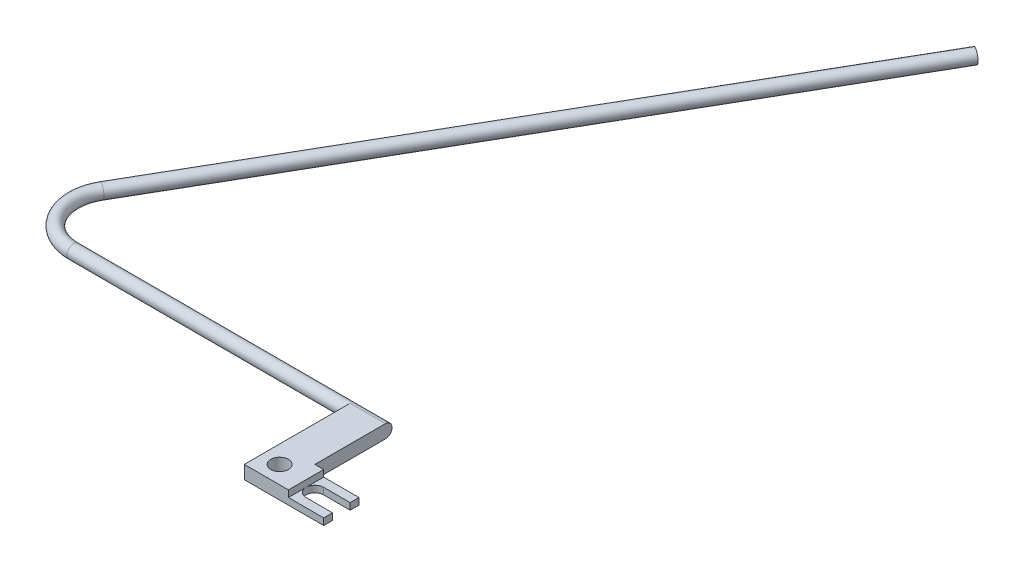
ISO-10303-21;
HEADER;
FILE_DESCRIPTION(('STEP AP214'),'2;1');
FILE_NAME('part.step','',(''),(''),'','','');
FILE_SCHEMA(('AUTOMOTIVE_DESIGN { 1 0 10303 214 1 1 1 1 }'));
ENDSEC;
DATA;
#1=APPLICATION_CONTEXT('core data for automotive mechanical design processes');
#2=APPLICATION_PROTOCOL_DEFINITION('international standard','automotive_design',2000,#1);
#3=PRODUCT_CONTEXT('',#1,'mechanical');
#4=PRODUCT('Part','Part','',(#3));
#5=PRODUCT_RELATED_PRODUCT_CATEGORY('part','',(#4));
#6=PRODUCT_DEFINITION_FORMATION('','',#4);
#7=PRODUCT_DEFINITION_CONTEXT('part definition',#1,'design');
#8=PRODUCT_DEFINITION('design','',#6,#7);
#9=PRODUCT_DEFINITION_SHAPE('','',#8);
#10=(LENGTH_UNIT() NAMED_UNIT(*) SI_UNIT(.MILLI.,.METRE.));
#11=(NAMED_UNIT(*) PLANE_ANGLE_UNIT() SI_UNIT($,.RADIAN.));
#12=(NAMED_UNIT(*) SI_UNIT($,.STERADIAN.) SOLID_ANGLE_UNIT());
#13=UNCERTAINTY_MEASURE_WITH_UNIT(LENGTH_MEASURE(1.E-05),#10,'distance_accuracy_value','');
#14=(GEOMETRIC_REPRESENTATION_CONTEXT(3) GLOBAL_UNCERTAINTY_ASSIGNED_CONTEXT((#13)) GLOBAL_UNIT_ASSIGNED_CONTEXT((#10,
#11,#12)) REPRESENTATION_CONTEXT('',''));
#15=CARTESIAN_POINT('',(0.,0.,0.));
#16=DIRECTION('',(0.,0.,1.));
#17=DIRECTION('',(1.,0.,0.));
#18=AXIS2_PLACEMENT_3D('',#15,#16,#17);
#19=CARTESIAN_POINT('',(3.99999999999999,3.,4.));
#20=DIRECTION('',(0.,1.,0.));
#21=DIRECTION('',(0.,0.,1.));
#22=AXIS2_PLACEMENT_3D('',#19,#20,#21);
#23=PLANE('',#22);
#24=DIRECTION('',(-1.,0.,0.));
#25=VECTOR('',#24,1.);
#26=CARTESIAN_POINT('',(2.,3.,-15.9963911959244));
#27=LINE('',#26,#25);
#28=CARTESIAN_POINT('',(0.,3.,-15.9963911959244));
#29=VERTEX_POINT('',#28);
#30=CARTESIAN_POINT('',(-8.,3.,-15.9963911959244));
#31=VERTEX_POINT('',#30);
#32=EDGE_CURVE('E126',#29,#31,#27,.T.);
#33=ORIENTED_EDGE('',*,*,#32,.T.);
#34=DIRECTION('',(0.,0.,1.));
#35=VECTOR('',#34,1.);
#36=CARTESIAN_POINT('',(-8.,3.,-20.));
#37=LINE('',#36,#35);
#38=CARTESIAN_POINT('',(-7.99999999999999,3.,8.));
#39=VERTEX_POINT('',#38);
#40=EDGE_CURVE('E130',#31,#39,#37,.T.);
#41=ORIENTED_EDGE('',*,*,#40,.T.);
#42=DIRECTION('',(1.,0.,0.));
#43=VECTOR('',#42,1.);
#44=CARTESIAN_POINT('',(-7.99999999999999,3.,8.));
#45=LINE('',#44,#43);
#46=CARTESIAN_POINT('',(2.,3.,8.));
#47=VERTEX_POINT('',#46);
#48=EDGE_CURVE('E140',#39,#47,#45,.T.);
#49=ORIENTED_EDGE('',*,*,#48,.T.);
#50=DIRECTION('',(0.,0.,-1.));
#51=VECTOR('',#50,1.);
#52=CARTESIAN_POINT('',(2.,3.,10.));
#53=LINE('',#52,#51);
#54=CARTESIAN_POINT('',(2.,3.,0.));
#55=VERTEX_POINT('',#54);
#56=EDGE_CURVE('E240',#47,#55,#53,.T.);
#57=ORIENTED_EDGE('',*,*,#56,.T.);
#58=DIRECTION('',(-1.,0.,0.));
#59=VECTOR('',#58,1.);
#60=CARTESIAN_POINT('',(10.,3.,0.));
#61=LINE('',#60,#59);
#62=CARTESIAN_POINT('',(0.,3.,0.));
#63=VERTEX_POINT('',#62);
#64=EDGE_CURVE('E167',#55,#63,#61,.T.);
#65=ORIENTED_EDGE('',*,*,#64,.T.);
#66=DIRECTION('',(0.,0.,-1.));
#67=VECTOR('',#66,1.);
#68=CARTESIAN_POINT('',(0.,3.,0.));
#69=LINE('',#68,#67);
#70=EDGE_CURVE('E133',#63,#29,#69,.T.);
#71=ORIENTED_EDGE('',*,*,#70,.T.);
#72=EDGE_LOOP('',(#33,#41,#49,#57,#65,#71));
#73=FACE_BOUND('',#72,.T.);
#74=CARTESIAN_POINT('',(-4.,3.,4.));
#75=DIRECTION('',(0.,1.,0.));
#76=DIRECTION('',(0.,0.,1.));
#77=AXIS2_PLACEMENT_3D('',#74,#75,#76);
#78=CIRCLE('',#77,2.);
#79=CARTESIAN_POINT('',(-4.,3.,6.));
#80=VERTEX_POINT('',#79);
#81=EDGE_CURVE('E160',#80,#80,#78,.T.);
#82=ORIENTED_EDGE('',*,*,#81,.F.);
#83=EDGE_LOOP('',(#82));
#84=FACE_BOUND('',#83,.T.);
#85=ADVANCED_FACE('F33',(#73,#84),#23,.T.);
#86=CARTESIAN_POINT('',(3.99999999999999,0.,4.));
#87=DIRECTION('',(0.,1.,0.));
#88=DIRECTION('',(0.,0.,1.));
#89=AXIS2_PLACEMENT_3D('',#86,#87,#88);
#90=PLANE('',#89);
#91=DIRECTION('',(0.,0.,1.));
#92=VECTOR('',#91,1.);
#93=CARTESIAN_POINT('',(-8.,0.,-20.));
#94=LINE('',#93,#92);
#95=CARTESIAN_POINT('',(-8.,0.,-15.9963911959244));
#96=VERTEX_POINT('',#95);
#97=CARTESIAN_POINT('',(-7.99999999999999,0.,8.));
#98=VERTEX_POINT('',#97);
#99=EDGE_CURVE('E163',#96,#98,#94,.T.);
#100=ORIENTED_EDGE('',*,*,#99,.F.);
#101=DIRECTION('',(-1.,0.,0.));
#102=VECTOR('',#101,1.);
#103=CARTESIAN_POINT('',(2.,0.,-15.9963911959244));
#104=LINE('',#103,#102);
#105=CARTESIAN_POINT('',(0.,0.,-15.9963911959244));
#106=VERTEX_POINT('',#105);
#107=EDGE_CURVE('E56',#106,#96,#104,.T.);
#108=ORIENTED_EDGE('',*,*,#107,.F.);
#109=DIRECTION('',(0.,0.,-1.));
#110=VECTOR('',#109,1.);
#111=CARTESIAN_POINT('',(0.,0.,0.));
#112=LINE('',#111,#110);
#113=CARTESIAN_POINT('',(0.,0.,0.));
#114=VERTEX_POINT('',#113);
#115=EDGE_CURVE('E141',#114,#106,#112,.T.);
#116=ORIENTED_EDGE('',*,*,#115,.F.);
#117=DIRECTION('',(-1.,0.,0.));
#118=VECTOR('',#117,1.);
#119=CARTESIAN_POINT('',(10.,0.,0.));
#120=LINE('',#119,#118);
#121=CARTESIAN_POINT('',(10.,0.,0.));
#122=VERTEX_POINT('',#121);
#123=EDGE_CURVE('E190',#122,#114,#120,.T.);
#124=ORIENTED_EDGE('',*,*,#123,.F.);
#125=DIRECTION('',(0.,0.,-1.));
#126=VECTOR('',#125,1.);
#127=CARTESIAN_POINT('',(10.,0.,2.));
#128=LINE('',#127,#126);
#129=CARTESIAN_POINT('',(10.,0.,2.));
#130=VERTEX_POINT('',#129);
#131=EDGE_CURVE('E187',#130,#122,#128,.T.);
#132=ORIENTED_EDGE('',*,*,#131,.F.);
#133=DIRECTION('',(1.,0.,0.));
#134=VECTOR('',#133,1.);
#135=CARTESIAN_POINT('',(3.99999999999999,0.,2.));
#136=LINE('',#135,#134);
#137=CARTESIAN_POINT('',(3.99999999999999,0.,2.));
#138=VERTEX_POINT('',#137);
#139=EDGE_CURVE('E184',#138,#130,#136,.T.);
#140=ORIENTED_EDGE('',*,*,#139,.F.);
#141=CARTESIAN_POINT('',(3.99999999999999,0.,4.));
#142=DIRECTION('',(0.,-1.,0.));
#143=DIRECTION('',(0.,0.,1.));
#144=AXIS2_PLACEMENT_3D('',#141,#142,#143);
#145=CIRCLE('',#144,2.);
#146=CARTESIAN_POINT('',(3.99999999999999,0.,6.));
#147=VERTEX_POINT('',#146);
#148=EDGE_CURVE('E181',#147,#138,#145,.T.);
#149=ORIENTED_EDGE('',*,*,#148,.F.);
#150=DIRECTION('',(-1.,0.,0.));
#151=VECTOR('',#150,1.);
#152=CARTESIAN_POINT('',(3.99999999999999,0.,6.));
#153=LINE('',#152,#151);
#154=CARTESIAN_POINT('',(10.,0.,6.));
#155=VERTEX_POINT('',#154);
#156=EDGE_CURVE('E178',#155,#147,#153,.T.);
#157=ORIENTED_EDGE('',*,*,#156,.F.);
#158=DIRECTION('',(0.,0.,-1.));
#159=VECTOR('',#158,1.);
#160=CARTESIAN_POINT('',(10.,0.,7.99999999999999));
#161=LINE('',#160,#159);
#162=CARTESIAN_POINT('',(10.,0.,7.99999999999999));
#163=VERTEX_POINT('',#162);
#164=EDGE_CURVE('E175',#163,#155,#161,.T.);
#165=ORIENTED_EDGE('',*,*,#164,.F.);
#166=DIRECTION('',(1.,0.,0.));
#167=VECTOR('',#166,1.);
#168=CARTESIAN_POINT('',(-7.99999999999999,0.,8.));
#169=LINE('',#168,#167);
#170=EDGE_CURVE('E172',#98,#163,#169,.T.);
#171=ORIENTED_EDGE('',*,*,#170,.F.);
#172=EDGE_LOOP('',(#100,#108,#116,#124,#132,#140,#149,#157,#165,#171));
#173=FACE_BOUND('',#172,.T.);
#174=CARTESIAN_POINT('',(-4.,0.,4.));
#175=DIRECTION('',(0.,1.,0.));
#176=DIRECTION('',(0.,0.,1.));
#177=AXIS2_PLACEMENT_3D('',#174,#175,#176);
#178=CIRCLE('',#177,2.);
#179=CARTESIAN_POINT('',(-4.,0.,6.));
#180=VERTEX_POINT('',#179);
#181=EDGE_CURVE('E159',#180,#180,#178,.T.);
#182=ORIENTED_EDGE('',*,*,#181,.T.);
#183=EDGE_LOOP('',(#182));
#184=FACE_BOUND('',#183,.T.);
#185=ADVANCED_FACE('F219',(#173,#184),#90,.F.);
#186=CARTESIAN_POINT('',(-8.,3.,-20.));
#187=DIRECTION('',(1.,0.,0.));
#188=DIRECTION('',(0.,0.,-1.));
#189=AXIS2_PLACEMENT_3D('',#186,#187,#188);
#190=PLANE('',#189);
#191=CARTESIAN_POINT('',(-8.,1.5,-15.9963911959244));
#192=DIRECTION('',(-1.,0.,0.));
#193=DIRECTION('',(0.,0.,1.));
#194=AXIS2_PLACEMENT_3D('',#191,#192,#193);
#195=CIRCLE('',#194,1.5);
#196=EDGE_CURVE('E41',#96,#31,#195,.T.);
#197=ORIENTED_EDGE('',*,*,#196,.F.);
#198=ORIENTED_EDGE('',*,*,#99,.T.);
#199=DIRECTION('',(0.,-1.,0.));
#200=VECTOR('',#199,1.);
#201=CARTESIAN_POINT('',(-7.99999999999999,3.,8.));
#202=LINE('',#201,#200);
#203=EDGE_CURVE('E138',#39,#98,#202,.T.);
#204=ORIENTED_EDGE('',*,*,#203,.F.);
#205=ORIENTED_EDGE('',*,*,#40,.F.);
#206=EDGE_LOOP('',(#197,#198,#204,#205));
#207=FACE_BOUND('',#206,.T.);
#208=ADVANCED_FACE('F35',(#207),#190,.F.);
#209=CARTESIAN_POINT('',(-7.99999999999999,3.,8.));
#210=DIRECTION('',(0.,0.,-1.));
#211=DIRECTION('',(-1.,0.,0.));
#212=AXIS2_PLACEMENT_3D('',#209,#210,#211);
#213=PLANE('',#212);
#214=DIRECTION('',(-1.,0.,0.));
#215=VECTOR('',#214,1.);
#216=CARTESIAN_POINT('',(-7.99999999999999,1.5,8.));
#217=LINE('',#216,#215);
#218=CARTESIAN_POINT('',(10.,1.5,7.99999999999999));
#219=VERTEX_POINT('',#218);
#220=CARTESIAN_POINT('',(2.,1.5,8.));
#221=VERTEX_POINT('',#220);
#222=EDGE_CURVE('E230',#219,#221,#217,.T.);
#223=ORIENTED_EDGE('',*,*,#222,.T.);
#224=DIRECTION('',(0.,1.,0.));
#225=VECTOR('',#224,1.);
#226=CARTESIAN_POINT('',(2.,3.,8.));
#227=LINE('',#226,#225);
#228=EDGE_CURVE('E148',#221,#47,#227,.T.);
#229=ORIENTED_EDGE('',*,*,#228,.T.);
#230=ORIENTED_EDGE('',*,*,#48,.F.);
#231=ORIENTED_EDGE('',*,*,#203,.T.);
#232=ORIENTED_EDGE('',*,*,#170,.T.);
#233=DIRECTION('',(0.,-1.,0.));
#234=VECTOR('',#233,1.);
#235=CARTESIAN_POINT('',(10.,3.,7.99999999999999));
#236=LINE('',#235,#234);
#237=EDGE_CURVE('E145',#219,#163,#236,.T.);
#238=ORIENTED_EDGE('',*,*,#237,.F.);
#239=EDGE_LOOP('',(#223,#229,#230,#231,#232,#238));
#240=FACE_BOUND('',#239,.T.);
#241=ADVANCED_FACE('F217',(#240),#213,.F.);
#242=CARTESIAN_POINT('',(10.,3.,7.99999999999999));
#243=DIRECTION('',(-1.,0.,0.));
#244=DIRECTION('',(0.,0.,1.));
#245=AXIS2_PLACEMENT_3D('',#242,#243,#244);
#246=PLANE('',#245);
#247=DIRECTION('',(0.,-1.,0.));
#248=VECTOR('',#247,1.);
#249=CARTESIAN_POINT('',(10.,3.,6.));
#250=LINE('',#249,#248);
#251=CARTESIAN_POINT('',(10.,1.5,6.));
#252=VERTEX_POINT('',#251);
#253=EDGE_CURVE('E204',#252,#155,#250,.T.);
#254=ORIENTED_EDGE('',*,*,#253,.F.);
#255=DIRECTION('',(0.,0.,-1.));
#256=VECTOR('',#255,1.);
#257=CARTESIAN_POINT('',(10.,1.5,10.));
#258=LINE('',#257,#256);
#259=EDGE_CURVE('E213',#219,#252,#258,.T.);
#260=ORIENTED_EDGE('',*,*,#259,.F.);
#261=ORIENTED_EDGE('',*,*,#237,.T.);
#262=ORIENTED_EDGE('',*,*,#164,.T.);
#263=EDGE_LOOP('',(#254,#260,#261,#262));
#264=FACE_BOUND('',#263,.T.);
#265=ADVANCED_FACE('F210',(#264),#246,.F.);
#266=CARTESIAN_POINT('',(3.99999999999999,3.,6.));
#267=DIRECTION('',(0.,0.,1.));
#268=DIRECTION('',(1.,0.,0.));
#269=AXIS2_PLACEMENT_3D('',#266,#267,#268);
#270=PLANE('',#269);
#271=DIRECTION('',(0.,-1.,0.));
#272=VECTOR('',#271,1.);
#273=CARTESIAN_POINT('',(3.99999999999999,3.,6.));
#274=LINE('',#273,#272);
#275=CARTESIAN_POINT('',(3.99999999999999,1.5,6.));
#276=VERTEX_POINT('',#275);
#277=EDGE_CURVE('E202',#276,#147,#274,.T.);
#278=ORIENTED_EDGE('',*,*,#277,.F.);
#279=DIRECTION('',(1.,0.,0.));
#280=VECTOR('',#279,1.);
#281=CARTESIAN_POINT('',(3.99999999999999,1.5,6.));
#282=LINE('',#281,#280);
#283=EDGE_CURVE('E227',#276,#252,#282,.T.);
#284=ORIENTED_EDGE('',*,*,#283,.T.);
#285=ORIENTED_EDGE('',*,*,#253,.T.);
#286=ORIENTED_EDGE('',*,*,#156,.T.);
#287=EDGE_LOOP('',(#278,#284,#285,#286));
#288=FACE_BOUND('',#287,.T.);
#289=ADVANCED_FACE('F225',(#288),#270,.F.);
#290=CARTESIAN_POINT('',(3.99999999999999,3.,4.));
#291=DIRECTION('',(0.,-1.,0.));
#292=DIRECTION('',(0.,0.,-1.));
#293=AXIS2_PLACEMENT_3D('',#290,#291,#292);
#294=CYLINDRICAL_SURFACE('',#293,2.);
#295=CARTESIAN_POINT('',(3.99999999999999,1.5,4.));
#296=DIRECTION('',(0.,-1.,0.));
#297=DIRECTION('',(0.,0.,-1.));
#298=AXIS2_PLACEMENT_3D('',#295,#296,#297);
#299=CIRCLE('',#298,2.);
#300=CARTESIAN_POINT('',(3.99999999999999,1.5,2.));
#301=VERTEX_POINT('',#300);
#302=CARTESIAN_POINT('',(2.,1.5,4.));
#303=VERTEX_POINT('',#302);
#304=EDGE_CURVE('E233',#301,#303,#299,.F.);
#305=ORIENTED_EDGE('',*,*,#304,.T.);
#306=EDGE_CURVE('E231',#303,#276,#299,.F.);
#307=ORIENTED_EDGE('',*,*,#306,.T.);
#308=ORIENTED_EDGE('',*,*,#277,.T.);
#309=ORIENTED_EDGE('',*,*,#148,.T.);
#310=DIRECTION('',(0.,-1.,0.));
#311=VECTOR('',#310,1.);
#312=CARTESIAN_POINT('',(3.99999999999999,3.,2.));
#313=LINE('',#312,#311);
#314=EDGE_CURVE('E200',#301,#138,#313,.T.);
#315=ORIENTED_EDGE('',*,*,#314,.F.);
#316=EDGE_LOOP('',(#305,#307,#308,#309,#315));
#317=FACE_BOUND('',#316,.T.);
#318=ADVANCED_FACE('F266',(#317),#294,.F.);
#319=CARTESIAN_POINT('',(3.99999999999999,3.,2.));
#320=DIRECTION('',(0.,0.,-1.));
#321=DIRECTION('',(-1.,0.,0.));
#322=AXIS2_PLACEMENT_3D('',#319,#320,#321);
#323=PLANE('',#322);
#324=DIRECTION('',(0.,-1.,0.));
#325=VECTOR('',#324,1.);
#326=CARTESIAN_POINT('',(10.,3.,2.));
#327=LINE('',#326,#325);
#328=CARTESIAN_POINT('',(10.,1.5,2.));
#329=VERTEX_POINT('',#328);
#330=EDGE_CURVE('E198',#329,#130,#327,.T.);
#331=ORIENTED_EDGE('',*,*,#330,.F.);
#332=DIRECTION('',(-1.,0.,0.));
#333=VECTOR('',#332,1.);
#334=CARTESIAN_POINT('',(3.99999999999999,1.5,2.));
#335=LINE('',#334,#333);
#336=EDGE_CURVE('E237',#329,#301,#335,.T.);
#337=ORIENTED_EDGE('',*,*,#336,.T.);
#338=ORIENTED_EDGE('',*,*,#314,.T.);
#339=ORIENTED_EDGE('',*,*,#139,.T.);
#340=EDGE_LOOP('',(#331,#337,#338,#339));
#341=FACE_BOUND('',#340,.T.);
#342=ADVANCED_FACE('F269',(#341),#323,.F.);
#343=CARTESIAN_POINT('',(10.,3.,2.));
#344=DIRECTION('',(-1.,0.,0.));
#345=DIRECTION('',(0.,0.,1.));
#346=AXIS2_PLACEMENT_3D('',#343,#344,#345);
#347=PLANE('',#346);
#348=DIRECTION('',(0.,-1.,0.));
#349=VECTOR('',#348,1.);
#350=CARTESIAN_POINT('',(10.,3.,0.));
#351=LINE('',#350,#349);
#352=CARTESIAN_POINT('',(10.,1.5,0.));
#353=VERTEX_POINT('',#352);
#354=EDGE_CURVE('E196',#353,#122,#351,.T.);
#355=ORIENTED_EDGE('',*,*,#354,.F.);
#356=EDGE_CURVE('E48',#329,#353,#258,.T.);
#357=ORIENTED_EDGE('',*,*,#356,.F.);
#358=ORIENTED_EDGE('',*,*,#330,.T.);
#359=ORIENTED_EDGE('',*,*,#131,.T.);
#360=EDGE_LOOP('',(#355,#357,#358,#359));
#361=FACE_BOUND('',#360,.T.);
#362=ADVANCED_FACE('F272',(#361),#347,.F.);
#363=CARTESIAN_POINT('',(10.,3.,0.));
#364=DIRECTION('',(0.,0.,1.));
#365=DIRECTION('',(1.,0.,0.));
#366=AXIS2_PLACEMENT_3D('',#363,#364,#365);
#367=PLANE('',#366);
#368=ORIENTED_EDGE('',*,*,#64,.F.);
#369=DIRECTION('',(0.,1.,0.));
#370=VECTOR('',#369,1.);
#371=CARTESIAN_POINT('',(2.,3.,0.));
#372=LINE('',#371,#370);
#373=CARTESIAN_POINT('',(2.,1.5,0.));
#374=VERTEX_POINT('',#373);
#375=EDGE_CURVE('E242',#374,#55,#372,.T.);
#376=ORIENTED_EDGE('',*,*,#375,.F.);
#377=DIRECTION('',(-1.,0.,0.));
#378=VECTOR('',#377,1.);
#379=CARTESIAN_POINT('',(10.,1.5,0.));
#380=LINE('',#379,#378);
#381=EDGE_CURVE('E249',#353,#374,#380,.T.);
#382=ORIENTED_EDGE('',*,*,#381,.F.);
#383=ORIENTED_EDGE('',*,*,#354,.T.);
#384=ORIENTED_EDGE('',*,*,#123,.T.);
#385=DIRECTION('',(0.,-1.,0.));
#386=VECTOR('',#385,1.);
#387=CARTESIAN_POINT('',(0.,3.,0.));
#388=LINE('',#387,#386);
#389=EDGE_CURVE('E170',#63,#114,#388,.T.);
#390=ORIENTED_EDGE('',*,*,#389,.F.);
#391=EDGE_LOOP('',(#368,#376,#382,#383,#384,#390));
#392=FACE_BOUND('',#391,.T.);
#393=ADVANCED_FACE('F258',(#392),#367,.F.);
#394=CARTESIAN_POINT('',(0.,3.,0.));
#395=DIRECTION('',(-1.,0.,0.));
#396=DIRECTION('',(0.,0.,1.));
#397=AXIS2_PLACEMENT_3D('',#394,#395,#396);
#398=PLANE('',#397);
#399=ORIENTED_EDGE('',*,*,#115,.T.);
#400=CARTESIAN_POINT('',(0.,1.5,-15.9963911959244));
#401=DIRECTION('',(-1.,0.,0.));
#402=DIRECTION('',(0.,0.,1.));
#403=AXIS2_PLACEMENT_3D('',#400,#401,#402);
#404=CIRCLE('',#403,1.5);
#405=EDGE_CURVE('E11',#106,#29,#404,.F.);
#406=ORIENTED_EDGE('',*,*,#405,.T.);
#407=ORIENTED_EDGE('',*,*,#70,.F.);
#408=ORIENTED_EDGE('',*,*,#389,.T.);
#409=EDGE_LOOP('',(#399,#406,#407,#408));
#410=FACE_BOUND('',#409,.T.);
#411=ADVANCED_FACE('F276',(#410),#398,.F.);
#412=CARTESIAN_POINT('',(-4.,3.,4.));
#413=DIRECTION('',(0.,-1.,0.));
#414=DIRECTION('',(0.,0.,-1.));
#415=AXIS2_PLACEMENT_3D('',#412,#413,#414);
#416=CYLINDRICAL_SURFACE('',#415,2.);
#417=ORIENTED_EDGE('',*,*,#81,.T.);
#418=EDGE_LOOP('',(#417));
#419=FACE_BOUND('',#418,.T.);
#420=ORIENTED_EDGE('',*,*,#181,.F.);
#421=EDGE_LOOP('',(#420));
#422=FACE_BOUND('',#421,.T.);
#423=ADVANCED_FACE('F278',(#419,#422),#416,.F.);
#424=CARTESIAN_POINT('',(-6.8428712781617,1.5,-156.575487950781));
#425=DIRECTION('',(0.500000000000004,0.,-0.866025403784436));
#426=DIRECTION('',(-0.866025403784436,0.,-0.500000000000004));
#427=AXIS2_PLACEMENT_3D('',#424,#425,#426);
#428=PLANE('',#427);
#429=CARTESIAN_POINT('',(-6.8428712781617,1.5,-156.575487950781));
#430=DIRECTION('',(0.500000000000004,0.,-0.866025403784436));
#431=DIRECTION('',(-0.866025403784436,0.,-0.500000000000004));
#432=AXIS2_PLACEMENT_3D('',#429,#430,#431);
#433=CIRCLE('',#432,1.5);
#434=CARTESIAN_POINT('',(-8.14190938383835,1.5,-157.325487950781));
#435=VERTEX_POINT('',#434);
#436=EDGE_CURVE('E156',#435,#435,#433,.T.);
#437=ORIENTED_EDGE('',*,*,#436,.T.);
#438=EDGE_LOOP('',(#437));
#439=FACE_BOUND('',#438,.T.);
#440=ADVANCED_FACE('F284',(#439),#428,.T.);
#441=CARTESIAN_POINT('',(-8.,1.5,-15.9963911959244));
#442=DIRECTION('',(-1.,0.,0.));
#443=DIRECTION('',(0.,0.,1.));
#444=AXIS2_PLACEMENT_3D('',#441,#442,#443);
#445=CYLINDRICAL_SURFACE('',#444,1.5);
#446=CARTESIAN_POINT('',(-70.6794919243111,1.5,-15.9963911959244));
#447=DIRECTION('',(-1.,0.,0.));
#448=DIRECTION('',(0.,0.,1.));
#449=AXIS2_PLACEMENT_3D('',#446,#447,#448);
#450=CIRCLE('',#449,1.5);
#451=CARTESIAN_POINT('',(-70.6794919243111,1.5,-14.4963911959244));
#452=VERTEX_POINT('',#451);
#453=EDGE_CURVE('E150',#452,#452,#450,.T.);
#454=ORIENTED_EDGE('',*,*,#453,.F.);
#455=EDGE_LOOP('',(#454));
#456=FACE_BOUND('',#455,.T.);
#457=ORIENTED_EDGE('',*,*,#196,.T.);
#458=ORIENTED_EDGE('',*,*,#32,.F.);
#459=ORIENTED_EDGE('',*,*,#405,.F.);
#460=ORIENTED_EDGE('',*,*,#107,.T.);
#461=EDGE_LOOP('',(#457,#458,#459,#460));
#462=FACE_BOUND('',#461,.T.);
#463=ADVANCED_FACE('F143',(#456,#462),#445,.T.);
#464=CARTESIAN_POINT('',(-70.6794919243111,1.5,-26.));
#465=DIRECTION('',(0.,-1.,0.));
#466=DIRECTION('',(0.,0.,-1.));
#467=AXIS2_PLACEMENT_3D('',#464,#465,#466);
#468=TOROIDAL_SURFACE('',#467,10.0036088040756,1.5);
#469=CARTESIAN_POINT('',(-79.3428712781622,1.5,-31.0018044020378));
#470=DIRECTION('',(0.500000000000003,0.,-0.866025403784437));
#471=DIRECTION('',(-0.866025403784437,0.,-0.500000000000003));
#472=AXIS2_PLACEMENT_3D('',#469,#470,#471);
#473=CIRCLE('',#472,1.5);
#474=CARTESIAN_POINT('',(-80.6419093838389,1.5,-31.7518044020378));
#475=VERTEX_POINT('',#474);
#476=EDGE_CURVE('E153',#475,#475,#473,.T.);
#477=CARTESIAN_POINT('',(-70.6794919243111,1.5,-26.));
#478=DIRECTION('',(0.,-1.,0.));
#479=DIRECTION('',(0.,0.,-1.));
#480=AXIS2_PLACEMENT_3D('',#477,#478,#479);
#481=CIRCLE('',#480,11.5036088040756);
#482=EDGE_CURVE('',#452,#475,#481,.T.);
#483=ORIENTED_EDGE('',*,*,#453,.T.);
#484=ORIENTED_EDGE('',*,*,#476,.F.);
#485=ORIENTED_EDGE('',*,*,#482,.T.);
#486=ORIENTED_EDGE('',*,*,#482,.F.);
#487=EDGE_LOOP('',(#483,#485,#484,#486));
#488=FACE_BOUND('',#487,.T.);
#489=ADVANCED_FACE('F301',(#488),#468,.T.);
#490=CARTESIAN_POINT('',(-79.3428712781622,1.5,-31.0018044020378));
#491=DIRECTION('',(0.500000000000004,0.,-0.866025403784437));
#492=DIRECTION('',(-0.866025403784436,0.,-0.500000000000004));
#493=AXIS2_PLACEMENT_3D('',#490,#491,#492);
#494=CYLINDRICAL_SURFACE('',#493,1.5);
#495=ORIENTED_EDGE('',*,*,#436,.F.);
#496=EDGE_LOOP('',(#495));
#497=FACE_BOUND('',#496,.T.);
#498=ORIENTED_EDGE('',*,*,#476,.T.);
#499=EDGE_LOOP('',(#498));
#500=FACE_BOUND('',#499,.T.);
#501=ADVANCED_FACE('F287',(#497,#500),#494,.T.);
#502=CARTESIAN_POINT('',(2.,3.,10.));
#503=DIRECTION('',(-1.,0.,0.));
#504=DIRECTION('',(0.,0.,1.));
#505=AXIS2_PLACEMENT_3D('',#502,#503,#504);
#506=PLANE('',#505);
#507=DIRECTION('',(0.,0.,-1.));
#508=VECTOR('',#507,1.);
#509=CARTESIAN_POINT('',(2.,1.5,10.));
#510=LINE('',#509,#508);
#511=EDGE_CURVE('E245',#221,#303,#510,.T.);
#512=ORIENTED_EDGE('',*,*,#511,.T.);
#513=EDGE_CURVE('E243',#303,#374,#510,.T.);
#514=ORIENTED_EDGE('',*,*,#513,.T.);
#515=ORIENTED_EDGE('',*,*,#375,.T.);
#516=ORIENTED_EDGE('',*,*,#56,.F.);
#517=ORIENTED_EDGE('',*,*,#228,.F.);
#518=EDGE_LOOP('',(#512,#514,#515,#516,#517));
#519=FACE_BOUND('',#518,.T.);
#520=ADVANCED_FACE('F261',(#519),#506,.F.);
#521=CARTESIAN_POINT('',(10.,1.5,10.));
#522=DIRECTION('',(0.,-1.,0.));
#523=DIRECTION('',(0.,0.,-1.));
#524=AXIS2_PLACEMENT_3D('',#521,#522,#523);
#525=PLANE('',#524);
#526=ORIENTED_EDGE('',*,*,#259,.T.);
#527=ORIENTED_EDGE('',*,*,#283,.F.);
#528=ORIENTED_EDGE('',*,*,#306,.F.);
#529=ORIENTED_EDGE('',*,*,#511,.F.);
#530=ORIENTED_EDGE('',*,*,#222,.F.);
#531=EDGE_LOOP('',(#526,#527,#528,#529,#530));
#532=FACE_BOUND('',#531,.T.);
#533=ADVANCED_FACE('F309',(#532),#525,.F.);
#534=ORIENTED_EDGE('',*,*,#336,.F.);
#535=ORIENTED_EDGE('',*,*,#356,.T.);
#536=ORIENTED_EDGE('',*,*,#381,.T.);
#537=ORIENTED_EDGE('',*,*,#513,.F.);
#538=ORIENTED_EDGE('',*,*,#304,.F.);
#539=EDGE_LOOP('',(#534,#535,#536,#537,#538));
#540=FACE_BOUND('',#539,.T.);
#541=ADVANCED_FACE('F253',(#540),#525,.F.);
#542=CLOSED_SHELL('',(#85,#185,#208,#241,#265,#289,#318,#342,#362,#393,#411,#423,#440,#463,#489,
#501,#520,#533,#541));
#543=MANIFOLD_SOLID_BREP('B2',#542);
#544=ADVANCED_BREP_SHAPE_REPRESENTATION('',(#18,#543),#14);
#545=SHAPE_DEFINITION_REPRESENTATION(#9,#544);
ENDSEC;
END-ISO-10303-21;
